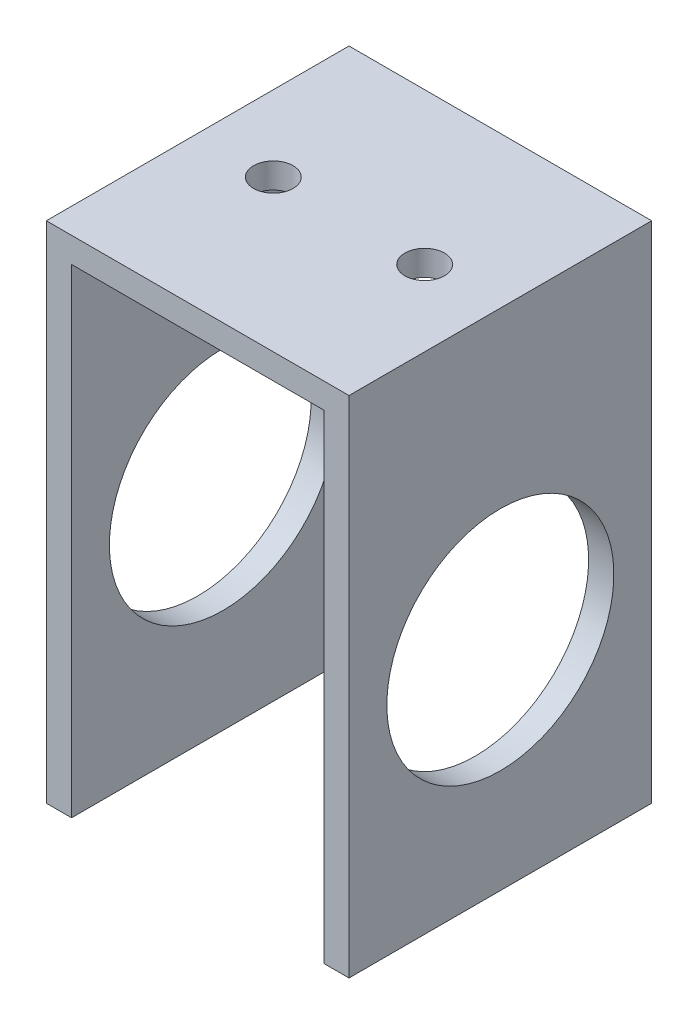
ISO-10303-21;
HEADER;
FILE_DESCRIPTION(('STEP AP214'),'2;1');
FILE_NAME('part.step','',(''),(''),'','','');
FILE_SCHEMA(('AUTOMOTIVE_DESIGN { 1 0 10303 214 1 1 1 1 }'));
ENDSEC;
DATA;
#1=APPLICATION_CONTEXT('core data for automotive mechanical design processes');
#2=APPLICATION_PROTOCOL_DEFINITION('international standard','automotive_design',2000,#1);
#3=PRODUCT_CONTEXT('',#1,'mechanical');
#4=PRODUCT('Part','Part','',(#3));
#5=PRODUCT_RELATED_PRODUCT_CATEGORY('part','',(#4));
#6=PRODUCT_DEFINITION_FORMATION('','',#4);
#7=PRODUCT_DEFINITION_CONTEXT('part definition',#1,'design');
#8=PRODUCT_DEFINITION('design','',#6,#7);
#9=PRODUCT_DEFINITION_SHAPE('','',#8);
#10=(LENGTH_UNIT() NAMED_UNIT(*) SI_UNIT(.MILLI.,.METRE.));
#11=(NAMED_UNIT(*) PLANE_ANGLE_UNIT() SI_UNIT($,.RADIAN.));
#12=(NAMED_UNIT(*) SI_UNIT($,.STERADIAN.) SOLID_ANGLE_UNIT());
#13=UNCERTAINTY_MEASURE_WITH_UNIT(LENGTH_MEASURE(1.E-05),#10,'distance_accuracy_value','');
#14=(GEOMETRIC_REPRESENTATION_CONTEXT(3) GLOBAL_UNCERTAINTY_ASSIGNED_CONTEXT((#13)) GLOBAL_UNIT_ASSIGNED_CONTEXT((#10,
#11,#12)) REPRESENTATION_CONTEXT('',''));
#15=CARTESIAN_POINT('',(0.,0.,0.));
#16=DIRECTION('',(0.,0.,1.));
#17=DIRECTION('',(1.,0.,0.));
#18=AXIS2_PLACEMENT_3D('',#15,#16,#17);
#19=CARTESIAN_POINT('',(-19.05,-63.5,38.1));
#20=DIRECTION('',(1.,0.,0.));
#21=DIRECTION('',(0.,0.,-1.));
#22=AXIS2_PLACEMENT_3D('',#19,#20,#21);
#23=PLANE('',#22);
#24=CARTESIAN_POINT('',(-19.05,-36.1499912,19.05));
#25=DIRECTION('',(1.,0.,0.));
#26=DIRECTION('',(0.,1.,0.));
#27=AXIS2_PLACEMENT_3D('',#24,#25,#26);
#28=CIRCLE('',#27,14.2875);
#29=CARTESIAN_POINT('',(-19.05,-21.8624912,19.05));
#30=VERTEX_POINT('',#29);
#31=EDGE_CURVE('E183',#30,#30,#28,.T.);
#32=ORIENTED_EDGE('',*,*,#31,.T.);
#33=EDGE_LOOP('',(#32));
#34=FACE_BOUND('',#33,.T.);
#35=DIRECTION('',(0.,-1.,0.));
#36=VECTOR('',#35,1.);
#37=CARTESIAN_POINT('',(-19.05,-63.5,0.));
#38=LINE('',#37,#36);
#39=CARTESIAN_POINT('',(-19.05,0.,0.));
#40=VERTEX_POINT('',#39);
#41=CARTESIAN_POINT('',(-19.05,-63.5,0.));
#42=VERTEX_POINT('',#41);
#43=EDGE_CURVE('E130',#40,#42,#38,.T.);
#44=ORIENTED_EDGE('',*,*,#43,.T.);
#45=DIRECTION('',(0.,0.,-1.));
#46=VECTOR('',#45,1.);
#47=CARTESIAN_POINT('',(-19.05,-63.5,38.1));
#48=LINE('',#47,#46);
#49=CARTESIAN_POINT('',(-19.05,-63.5,38.1));
#50=VERTEX_POINT('',#49);
#51=EDGE_CURVE('E11',#50,#42,#48,.T.);
#52=ORIENTED_EDGE('',*,*,#51,.F.);
#53=DIRECTION('',(0.,-1.,0.));
#54=VECTOR('',#53,1.);
#55=CARTESIAN_POINT('',(-19.05,-63.5,38.1));
#56=LINE('',#55,#54);
#57=CARTESIAN_POINT('',(-19.05,0.,38.1));
#58=VERTEX_POINT('',#57);
#59=EDGE_CURVE('E145',#58,#50,#56,.T.);
#60=ORIENTED_EDGE('',*,*,#59,.F.);
#61=DIRECTION('',(0.,0.,-1.));
#62=VECTOR('',#61,1.);
#63=CARTESIAN_POINT('',(-19.05,0.,38.1));
#64=LINE('',#63,#62);
#65=EDGE_CURVE('E126',#58,#40,#64,.T.);
#66=ORIENTED_EDGE('',*,*,#65,.T.);
#67=EDGE_LOOP('',(#44,#52,#60,#66));
#68=FACE_BOUND('',#67,.T.);
#69=ADVANCED_FACE('F34',(#34,#68),#23,.F.);
#70=CARTESIAN_POINT('',(-15.875,-63.5,38.1));
#71=DIRECTION('',(0.,1.,0.));
#72=DIRECTION('',(0.,0.,1.));
#73=AXIS2_PLACEMENT_3D('',#70,#71,#72);
#74=PLANE('',#73);
#75=DIRECTION('',(1.,0.,0.));
#76=VECTOR('',#75,1.);
#77=CARTESIAN_POINT('',(-15.875,-63.5,0.));
#78=LINE('',#77,#76);
#79=CARTESIAN_POINT('',(-15.875,-63.5,0.));
#80=VERTEX_POINT('',#79);
#81=EDGE_CURVE('E133',#42,#80,#78,.T.);
#82=ORIENTED_EDGE('',*,*,#81,.T.);
#83=DIRECTION('',(0.,0.,-1.));
#84=VECTOR('',#83,1.);
#85=CARTESIAN_POINT('',(-15.875,-63.5,38.1));
#86=LINE('',#85,#84);
#87=CARTESIAN_POINT('',(-15.875,-63.5,38.1));
#88=VERTEX_POINT('',#87);
#89=EDGE_CURVE('E42',#88,#80,#86,.T.);
#90=ORIENTED_EDGE('',*,*,#89,.F.);
#91=DIRECTION('',(1.,0.,0.));
#92=VECTOR('',#91,1.);
#93=CARTESIAN_POINT('',(-15.875,-63.5,38.1));
#94=LINE('',#93,#92);
#95=EDGE_CURVE('E93',#50,#88,#94,.T.);
#96=ORIENTED_EDGE('',*,*,#95,.F.);
#97=ORIENTED_EDGE('',*,*,#51,.T.);
#98=EDGE_LOOP('',(#82,#90,#96,#97));
#99=FACE_BOUND('',#98,.T.);
#100=ADVANCED_FACE('F226',(#99),#74,.F.);
#101=CARTESIAN_POINT('',(-15.875,-3.175,38.1));
#102=DIRECTION('',(-1.,0.,0.));
#103=DIRECTION('',(0.,-1.,0.));
#104=AXIS2_PLACEMENT_3D('',#101,#102,#103);
#105=PLANE('',#104);
#106=CARTESIAN_POINT('',(-15.875,-36.1499912,19.05));
#107=DIRECTION('',(-1.,0.,0.));
#108=DIRECTION('',(0.,-1.,0.));
#109=AXIS2_PLACEMENT_3D('',#106,#107,#108);
#110=CIRCLE('',#109,14.2875);
#111=CARTESIAN_POINT('',(-15.875,-50.4374912,19.05));
#112=VERTEX_POINT('',#111);
#113=EDGE_CURVE('E134',#112,#112,#110,.T.);
#114=ORIENTED_EDGE('',*,*,#113,.T.);
#115=EDGE_LOOP('',(#114));
#116=FACE_BOUND('',#115,.T.);
#117=DIRECTION('',(0.,1.,0.));
#118=VECTOR('',#117,1.);
#119=CARTESIAN_POINT('',(-15.875,-3.175,0.));
#120=LINE('',#119,#118);
#121=CARTESIAN_POINT('',(-15.875,-3.175,0.));
#122=VERTEX_POINT('',#121);
#123=EDGE_CURVE('E136',#80,#122,#120,.T.);
#124=ORIENTED_EDGE('',*,*,#123,.T.);
#125=DIRECTION('',(0.,0.,-1.));
#126=VECTOR('',#125,1.);
#127=CARTESIAN_POINT('',(-15.875,-3.175,38.1));
#128=LINE('',#127,#126);
#129=CARTESIAN_POINT('',(-15.875,-3.175,38.1));
#130=VERTEX_POINT('',#129);
#131=EDGE_CURVE('E152',#130,#122,#128,.T.);
#132=ORIENTED_EDGE('',*,*,#131,.F.);
#133=DIRECTION('',(0.,1.,0.));
#134=VECTOR('',#133,1.);
#135=CARTESIAN_POINT('',(-15.875,-3.175,38.1));
#136=LINE('',#135,#134);
#137=EDGE_CURVE('E160',#88,#130,#136,.T.);
#138=ORIENTED_EDGE('',*,*,#137,.F.);
#139=ORIENTED_EDGE('',*,*,#89,.T.);
#140=EDGE_LOOP('',(#124,#132,#138,#139));
#141=FACE_BOUND('',#140,.T.);
#142=ADVANCED_FACE('F158',(#116,#141),#105,.F.);
#143=CARTESIAN_POINT('',(15.875,-3.17499999999999,38.1));
#144=DIRECTION('',(0.,1.,0.));
#145=DIRECTION('',(-1.,0.,0.));
#146=AXIS2_PLACEMENT_3D('',#143,#144,#145);
#147=PLANE('',#146);
#148=CARTESIAN_POINT('',(-9.525,-3.175,19.05));
#149=DIRECTION('',(0.,1.,0.));
#150=DIRECTION('',(-1.,0.,0.));
#151=AXIS2_PLACEMENT_3D('',#148,#149,#150);
#152=CIRCLE('',#151,2.48919999999999);
#153=CARTESIAN_POINT('',(-12.0142,-3.175,19.05));
#154=VERTEX_POINT('',#153);
#155=EDGE_CURVE('E195',#154,#154,#152,.T.);
#156=ORIENTED_EDGE('',*,*,#155,.T.);
#157=EDGE_LOOP('',(#156));
#158=FACE_BOUND('',#157,.T.);
#159=CARTESIAN_POINT('',(9.525,-3.17499999999999,19.05));
#160=DIRECTION('',(0.,1.,0.));
#161=DIRECTION('',(-1.,0.,0.));
#162=AXIS2_PLACEMENT_3D('',#159,#160,#161);
#163=CIRCLE('',#162,2.48919999999999);
#164=CARTESIAN_POINT('',(7.03580000000001,-3.175,19.05));
#165=VERTEX_POINT('',#164);
#166=EDGE_CURVE('E187',#165,#165,#163,.T.);
#167=ORIENTED_EDGE('',*,*,#166,.T.);
#168=EDGE_LOOP('',(#167));
#169=FACE_BOUND('',#168,.T.);
#170=DIRECTION('',(1.,0.,0.));
#171=VECTOR('',#170,1.);
#172=CARTESIAN_POINT('',(15.875,-3.17499999999999,0.));
#173=LINE('',#172,#171);
#174=CARTESIAN_POINT('',(15.875,-3.17499999999999,0.));
#175=VERTEX_POINT('',#174);
#176=EDGE_CURVE('E138',#122,#175,#173,.T.);
#177=ORIENTED_EDGE('',*,*,#176,.T.);
#178=DIRECTION('',(0.,0.,-1.));
#179=VECTOR('',#178,1.);
#180=CARTESIAN_POINT('',(15.875,-3.17499999999999,38.1));
#181=LINE('',#180,#179);
#182=CARTESIAN_POINT('',(15.875,-3.17499999999999,38.1));
#183=VERTEX_POINT('',#182);
#184=EDGE_CURVE('E149',#183,#175,#181,.T.);
#185=ORIENTED_EDGE('',*,*,#184,.F.);
#186=DIRECTION('',(1.,0.,0.));
#187=VECTOR('',#186,1.);
#188=CARTESIAN_POINT('',(15.875,-3.17499999999999,38.1));
#189=LINE('',#188,#187);
#190=EDGE_CURVE('E172',#130,#183,#189,.T.);
#191=ORIENTED_EDGE('',*,*,#190,.F.);
#192=ORIENTED_EDGE('',*,*,#131,.T.);
#193=EDGE_LOOP('',(#177,#185,#191,#192));
#194=FACE_BOUND('',#193,.T.);
#195=ADVANCED_FACE('F168',(#158,#169,#194),#147,.F.);
#196=CARTESIAN_POINT('',(15.875,-63.5,38.1));
#197=DIRECTION('',(1.,0.,0.));
#198=DIRECTION('',(0.,1.,0.));
#199=AXIS2_PLACEMENT_3D('',#196,#197,#198);
#200=PLANE('',#199);
#201=CARTESIAN_POINT('',(15.875,-36.1499912,19.05));
#202=DIRECTION('',(1.,0.,0.));
#203=DIRECTION('',(0.,1.,0.));
#204=AXIS2_PLACEMENT_3D('',#201,#202,#203);
#205=CIRCLE('',#204,14.2875);
#206=CARTESIAN_POINT('',(15.875,-21.8624912,19.05));
#207=VERTEX_POINT('',#206);
#208=EDGE_CURVE('E180',#207,#207,#205,.T.);
#209=ORIENTED_EDGE('',*,*,#208,.T.);
#210=EDGE_LOOP('',(#209));
#211=FACE_BOUND('',#210,.T.);
#212=DIRECTION('',(0.,-1.,0.));
#213=VECTOR('',#212,1.);
#214=CARTESIAN_POINT('',(15.875,-63.5,0.));
#215=LINE('',#214,#213);
#216=CARTESIAN_POINT('',(15.875,-63.5,0.));
#217=VERTEX_POINT('',#216);
#218=EDGE_CURVE('E140',#175,#217,#215,.T.);
#219=ORIENTED_EDGE('',*,*,#218,.T.);
#220=DIRECTION('',(0.,0.,-1.));
#221=VECTOR('',#220,1.);
#222=CARTESIAN_POINT('',(15.875,-63.5,38.1));
#223=LINE('',#222,#221);
#224=CARTESIAN_POINT('',(15.875,-63.5,38.1));
#225=VERTEX_POINT('',#224);
#226=EDGE_CURVE('E121',#225,#217,#223,.T.);
#227=ORIENTED_EDGE('',*,*,#226,.F.);
#228=DIRECTION('',(0.,-1.,0.));
#229=VECTOR('',#228,1.);
#230=CARTESIAN_POINT('',(15.875,-63.5,38.1));
#231=LINE('',#230,#229);
#232=EDGE_CURVE('E112',#183,#225,#231,.T.);
#233=ORIENTED_EDGE('',*,*,#232,.F.);
#234=ORIENTED_EDGE('',*,*,#184,.T.);
#235=EDGE_LOOP('',(#219,#227,#233,#234));
#236=FACE_BOUND('',#235,.T.);
#237=ADVANCED_FACE('F171',(#211,#236),#200,.F.);
#238=CARTESIAN_POINT('',(19.05,-63.5,38.1));
#239=DIRECTION('',(0.,1.,0.));
#240=DIRECTION('',(0.,0.,1.));
#241=AXIS2_PLACEMENT_3D('',#238,#239,#240);
#242=PLANE('',#241);
#243=DIRECTION('',(1.,0.,0.));
#244=VECTOR('',#243,1.);
#245=CARTESIAN_POINT('',(19.05,-63.5,0.));
#246=LINE('',#245,#244);
#247=CARTESIAN_POINT('',(19.05,-63.5,0.));
#248=VERTEX_POINT('',#247);
#249=EDGE_CURVE('E120',#217,#248,#246,.T.);
#250=ORIENTED_EDGE('',*,*,#249,.T.);
#251=DIRECTION('',(0.,0.,-1.));
#252=VECTOR('',#251,1.);
#253=CARTESIAN_POINT('',(19.05,-63.5,38.1));
#254=LINE('',#253,#252);
#255=CARTESIAN_POINT('',(19.05,-63.5,38.1));
#256=VERTEX_POINT('',#255);
#257=EDGE_CURVE('E117',#256,#248,#254,.T.);
#258=ORIENTED_EDGE('',*,*,#257,.F.);
#259=DIRECTION('',(1.,0.,0.));
#260=VECTOR('',#259,1.);
#261=CARTESIAN_POINT('',(19.05,-63.5,38.1));
#262=LINE('',#261,#260);
#263=EDGE_CURVE('E106',#225,#256,#262,.T.);
#264=ORIENTED_EDGE('',*,*,#263,.F.);
#265=ORIENTED_EDGE('',*,*,#226,.T.);
#266=EDGE_LOOP('',(#250,#258,#264,#265));
#267=FACE_BOUND('',#266,.T.);
#268=ADVANCED_FACE('F118',(#267),#242,.F.);
#269=CARTESIAN_POINT('',(19.05,0.,38.1));
#270=DIRECTION('',(-1.,0.,0.));
#271=DIRECTION('',(0.,-1.,0.));
#272=AXIS2_PLACEMENT_3D('',#269,#270,#271);
#273=PLANE('',#272);
#274=CARTESIAN_POINT('',(19.05,-36.1499912,19.05));
#275=DIRECTION('',(1.,0.,0.));
#276=DIRECTION('',(0.,1.,0.));
#277=AXIS2_PLACEMENT_3D('',#274,#275,#276);
#278=CIRCLE('',#277,14.2875);
#279=CARTESIAN_POINT('',(19.05,-21.8624912,19.05));
#280=VERTEX_POINT('',#279);
#281=EDGE_CURVE('E184',#280,#280,#278,.T.);
#282=ORIENTED_EDGE('',*,*,#281,.F.);
#283=EDGE_LOOP('',(#282));
#284=FACE_BOUND('',#283,.T.);
#285=DIRECTION('',(0.,1.,0.));
#286=VECTOR('',#285,1.);
#287=CARTESIAN_POINT('',(19.05,0.,0.));
#288=LINE('',#287,#286);
#289=CARTESIAN_POINT('',(19.05,0.,0.));
#290=VERTEX_POINT('',#289);
#291=EDGE_CURVE('E79',#248,#290,#288,.T.);
#292=ORIENTED_EDGE('',*,*,#291,.T.);
#293=DIRECTION('',(0.,0.,-1.));
#294=VECTOR('',#293,1.);
#295=CARTESIAN_POINT('',(19.05,0.,38.1));
#296=LINE('',#295,#294);
#297=CARTESIAN_POINT('',(19.05,0.,38.1));
#298=VERTEX_POINT('',#297);
#299=EDGE_CURVE('E122',#298,#290,#296,.T.);
#300=ORIENTED_EDGE('',*,*,#299,.F.);
#301=DIRECTION('',(0.,1.,0.));
#302=VECTOR('',#301,1.);
#303=CARTESIAN_POINT('',(19.05,0.,38.1));
#304=LINE('',#303,#302);
#305=EDGE_CURVE('E110',#256,#298,#304,.T.);
#306=ORIENTED_EDGE('',*,*,#305,.F.);
#307=ORIENTED_EDGE('',*,*,#257,.T.);
#308=EDGE_LOOP('',(#292,#300,#306,#307));
#309=FACE_BOUND('',#308,.T.);
#310=ADVANCED_FACE('F124',(#284,#309),#273,.F.);
#311=CARTESIAN_POINT('',(-19.05,0.,38.1));
#312=DIRECTION('',(0.,-1.,0.));
#313=DIRECTION('',(1.,0.,0.));
#314=AXIS2_PLACEMENT_3D('',#311,#312,#313);
#315=PLANE('',#314);
#316=CARTESIAN_POINT('',(-9.525,0.,19.05));
#317=DIRECTION('',(0.,1.,0.));
#318=DIRECTION('',(0.,0.,1.));
#319=AXIS2_PLACEMENT_3D('',#316,#317,#318);
#320=CIRCLE('',#319,2.48919999999999);
#321=CARTESIAN_POINT('',(-9.525,0.,21.5392));
#322=VERTEX_POINT('',#321);
#323=EDGE_CURVE('E198',#322,#322,#320,.T.);
#324=ORIENTED_EDGE('',*,*,#323,.F.);
#325=EDGE_LOOP('',(#324));
#326=FACE_BOUND('',#325,.T.);
#327=CARTESIAN_POINT('',(9.525,0.,19.05));
#328=DIRECTION('',(0.,1.,0.));
#329=DIRECTION('',(0.,0.,1.));
#330=AXIS2_PLACEMENT_3D('',#327,#328,#329);
#331=CIRCLE('',#330,2.48919999999999);
#332=CARTESIAN_POINT('',(9.525,0.,21.5392));
#333=VERTEX_POINT('',#332);
#334=EDGE_CURVE('E192',#333,#333,#331,.T.);
#335=ORIENTED_EDGE('',*,*,#334,.F.);
#336=EDGE_LOOP('',(#335));
#337=FACE_BOUND('',#336,.T.);
#338=DIRECTION('',(-1.,0.,0.));
#339=VECTOR('',#338,1.);
#340=CARTESIAN_POINT('',(-19.05,0.,0.));
#341=LINE('',#340,#339);
#342=EDGE_CURVE('E85',#290,#40,#341,.T.);
#343=ORIENTED_EDGE('',*,*,#342,.T.);
#344=ORIENTED_EDGE('',*,*,#65,.F.);
#345=DIRECTION('',(-1.,0.,0.));
#346=VECTOR('',#345,1.);
#347=CARTESIAN_POINT('',(-19.05,0.,38.1));
#348=LINE('',#347,#346);
#349=EDGE_CURVE('E50',#298,#58,#348,.T.);
#350=ORIENTED_EDGE('',*,*,#349,.F.);
#351=ORIENTED_EDGE('',*,*,#299,.T.);
#352=EDGE_LOOP('',(#343,#344,#350,#351));
#353=FACE_BOUND('',#352,.T.);
#354=ADVANCED_FACE('F204',(#326,#337,#353),#315,.F.);
#355=CARTESIAN_POINT('',(0.,0.,38.1));
#356=DIRECTION('',(0.,0.,-1.));
#357=DIRECTION('',(-1.,0.,0.));
#358=AXIS2_PLACEMENT_3D('',#355,#356,#357);
#359=PLANE('',#358);
#360=ORIENTED_EDGE('',*,*,#59,.T.);
#361=ORIENTED_EDGE('',*,*,#95,.T.);
#362=ORIENTED_EDGE('',*,*,#137,.T.);
#363=ORIENTED_EDGE('',*,*,#190,.T.);
#364=ORIENTED_EDGE('',*,*,#232,.T.);
#365=ORIENTED_EDGE('',*,*,#263,.T.);
#366=ORIENTED_EDGE('',*,*,#305,.T.);
#367=ORIENTED_EDGE('',*,*,#349,.T.);
#368=EDGE_LOOP('',(#360,#361,#362,#363,#364,#365,#366,#367));
#369=FACE_BOUND('',#368,.T.);
#370=ADVANCED_FACE('F108',(#369),#359,.F.);
#371=CARTESIAN_POINT('',(0.,0.,0.));
#372=DIRECTION('',(0.,0.,-1.));
#373=DIRECTION('',(-1.,0.,0.));
#374=AXIS2_PLACEMENT_3D('',#371,#372,#373);
#375=PLANE('',#374);
#376=ORIENTED_EDGE('',*,*,#43,.F.);
#377=ORIENTED_EDGE('',*,*,#342,.F.);
#378=ORIENTED_EDGE('',*,*,#291,.F.);
#379=ORIENTED_EDGE('',*,*,#249,.F.);
#380=ORIENTED_EDGE('',*,*,#218,.F.);
#381=ORIENTED_EDGE('',*,*,#176,.F.);
#382=ORIENTED_EDGE('',*,*,#123,.F.);
#383=ORIENTED_EDGE('',*,*,#81,.F.);
#384=EDGE_LOOP('',(#376,#377,#378,#379,#380,#381,#382,#383));
#385=FACE_BOUND('',#384,.T.);
#386=ADVANCED_FACE('F164',(#385),#375,.T.);
#387=CARTESIAN_POINT('',(-19.05,-36.1499912,19.05));
#388=DIRECTION('',(1.,0.,0.));
#389=DIRECTION('',(0.,1.,0.));
#390=AXIS2_PLACEMENT_3D('',#387,#388,#389);
#391=CYLINDRICAL_SURFACE('',#390,14.2875);
#392=ORIENTED_EDGE('',*,*,#281,.T.);
#393=EDGE_LOOP('',(#392));
#394=FACE_BOUND('',#393,.T.);
#395=ORIENTED_EDGE('',*,*,#208,.F.);
#396=EDGE_LOOP('',(#395));
#397=FACE_BOUND('',#396,.T.);
#398=ADVANCED_FACE('F221',(#394,#397),#391,.F.);
#399=ORIENTED_EDGE('',*,*,#31,.F.);
#400=EDGE_LOOP('',(#399));
#401=FACE_BOUND('',#400,.T.);
#402=ORIENTED_EDGE('',*,*,#113,.F.);
#403=EDGE_LOOP('',(#402));
#404=FACE_BOUND('',#403,.T.);
#405=ADVANCED_FACE('F212',(#401,#404),#391,.F.);
#406=CARTESIAN_POINT('',(9.525,0.,19.05));
#407=DIRECTION('',(0.,1.,0.));
#408=DIRECTION('',(0.,0.,1.));
#409=AXIS2_PLACEMENT_3D('',#406,#407,#408);
#410=CYLINDRICAL_SURFACE('',#409,2.48919999999999);
#411=ORIENTED_EDGE('',*,*,#166,.F.);
#412=EDGE_LOOP('',(#411));
#413=FACE_BOUND('',#412,.T.);
#414=ORIENTED_EDGE('',*,*,#334,.T.);
#415=EDGE_LOOP('',(#414));
#416=FACE_BOUND('',#415,.T.);
#417=ADVANCED_FACE('F210',(#413,#416),#410,.F.);
#418=CARTESIAN_POINT('',(-9.525,0.,19.05));
#419=DIRECTION('',(0.,1.,0.));
#420=DIRECTION('',(0.,0.,1.));
#421=AXIS2_PLACEMENT_3D('',#418,#419,#420);
#422=CYLINDRICAL_SURFACE('',#421,2.48919999999999);
#423=ORIENTED_EDGE('',*,*,#155,.F.);
#424=EDGE_LOOP('',(#423));
#425=FACE_BOUND('',#424,.T.);
#426=ORIENTED_EDGE('',*,*,#323,.T.);
#427=EDGE_LOOP('',(#426));
#428=FACE_BOUND('',#427,.T.);
#429=ADVANCED_FACE('F202',(#425,#428),#422,.F.);
#430=CLOSED_SHELL('',(#69,#100,#142,#195,#237,#268,#310,#354,#370,#386,#398,#405,#417,#429));
#431=MANIFOLD_SOLID_BREP('B2',#430);
#432=ADVANCED_BREP_SHAPE_REPRESENTATION('',(#18,#431),#14);
#433=SHAPE_DEFINITION_REPRESENTATION(#9,#432);
ENDSEC;
END-ISO-10303-21;
